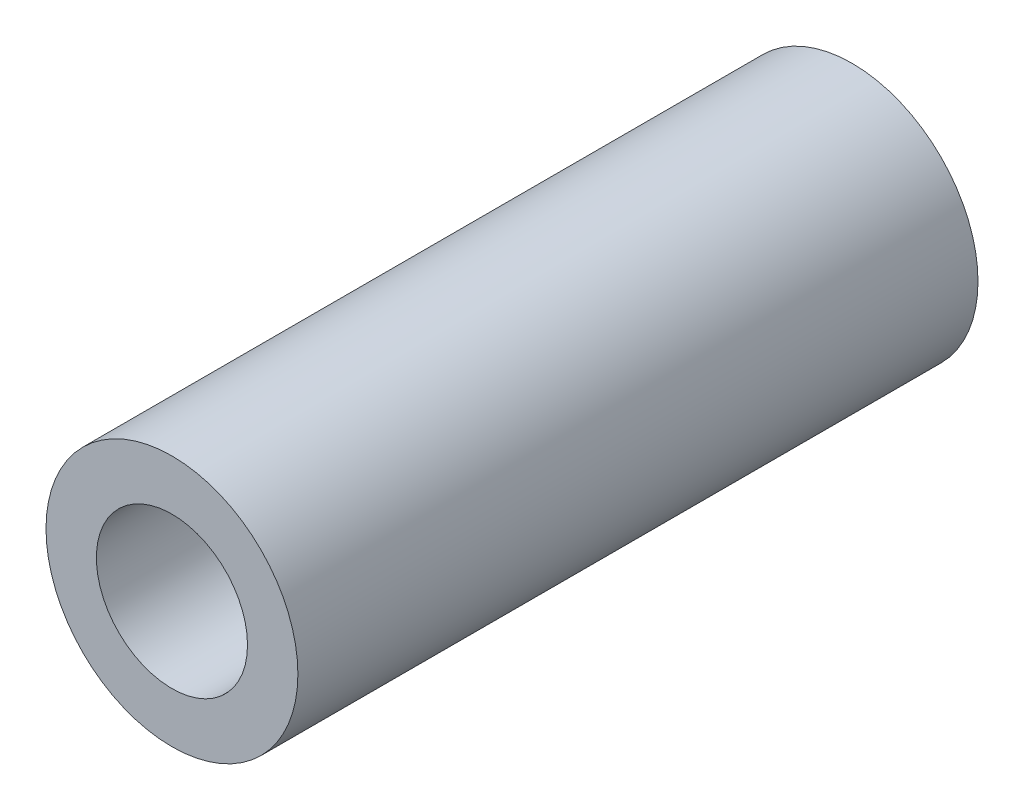
ISO-10303-21;
HEADER;
FILE_DESCRIPTION(('STEP AP214'),'2;1');
FILE_NAME('part.step','',(''),(''),'','','');
FILE_SCHEMA(('AUTOMOTIVE_DESIGN { 1 0 10303 214 1 1 1 1 }'));
ENDSEC;
DATA;
#1=APPLICATION_CONTEXT('core data for automotive mechanical design processes');
#2=APPLICATION_PROTOCOL_DEFINITION('international standard','automotive_design',2000,#1);
#3=PRODUCT_CONTEXT('',#1,'mechanical');
#4=PRODUCT('Part','Part','',(#3));
#5=PRODUCT_RELATED_PRODUCT_CATEGORY('part','',(#4));
#6=PRODUCT_DEFINITION_FORMATION('','',#4);
#7=PRODUCT_DEFINITION_CONTEXT('part definition',#1,'design');
#8=PRODUCT_DEFINITION('design','',#6,#7);
#9=PRODUCT_DEFINITION_SHAPE('','',#8);
#10=(LENGTH_UNIT() NAMED_UNIT(*) SI_UNIT(.MILLI.,.METRE.));
#11=(NAMED_UNIT(*) PLANE_ANGLE_UNIT() SI_UNIT($,.RADIAN.));
#12=(NAMED_UNIT(*) SI_UNIT($,.STERADIAN.) SOLID_ANGLE_UNIT());
#13=UNCERTAINTY_MEASURE_WITH_UNIT(LENGTH_MEASURE(1.E-05),#10,'distance_accuracy_value','');
#14=(GEOMETRIC_REPRESENTATION_CONTEXT(3) GLOBAL_UNCERTAINTY_ASSIGNED_CONTEXT((#13)) GLOBAL_UNIT_ASSIGNED_CONTEXT((#10,
#11,#12)) REPRESENTATION_CONTEXT('',''));
#15=CARTESIAN_POINT('',(0.,0.,0.));
#16=DIRECTION('',(0.,0.,1.));
#17=DIRECTION('',(1.,0.,0.));
#18=AXIS2_PLACEMENT_3D('',#15,#16,#17);
#19=CARTESIAN_POINT('',(0.,0.,27.));
#20=DIRECTION('',(0.,0.,1.));
#21=DIRECTION('',(1.,0.,0.));
#22=AXIS2_PLACEMENT_3D('',#19,#20,#21);
#23=PLANE('',#22);
#24=CARTESIAN_POINT('',(0.,0.,27.));
#25=DIRECTION('',(0.,0.,1.));
#26=DIRECTION('',(1.,0.,0.));
#27=AXIS2_PLACEMENT_3D('',#24,#25,#26);
#28=CIRCLE('',#27,5.);
#29=CARTESIAN_POINT('',(5.,0.,27.));
#30=VERTEX_POINT('',#29);
#31=EDGE_CURVE('E10',#30,#30,#28,.T.);
#32=ORIENTED_EDGE('',*,*,#31,.T.);
#33=EDGE_LOOP('',(#32));
#34=FACE_BOUND('',#33,.T.);
#35=CARTESIAN_POINT('',(0.,0.,27.));
#36=DIRECTION('',(0.,0.,1.));
#37=DIRECTION('',(1.,0.,0.));
#38=AXIS2_PLACEMENT_3D('',#35,#36,#37);
#39=CIRCLE('',#38,3.);
#40=CARTESIAN_POINT('',(3.,0.,27.));
#41=VERTEX_POINT('',#40);
#42=EDGE_CURVE('E42',#41,#41,#39,.T.);
#43=ORIENTED_EDGE('',*,*,#42,.F.);
#44=EDGE_LOOP('',(#43));
#45=FACE_BOUND('',#44,.T.);
#46=ADVANCED_FACE('F31',(#34,#45),#23,.T.);
#47=CARTESIAN_POINT('',(0.,0.,0.));
#48=DIRECTION('',(0.,0.,1.));
#49=DIRECTION('',(1.,0.,0.));
#50=AXIS2_PLACEMENT_3D('',#47,#48,#49);
#51=PLANE('',#50);
#52=CARTESIAN_POINT('',(0.,0.,0.));
#53=DIRECTION('',(0.,0.,1.));
#54=DIRECTION('',(1.,0.,0.));
#55=AXIS2_PLACEMENT_3D('',#52,#53,#54);
#56=CIRCLE('',#55,5.);
#57=CARTESIAN_POINT('',(5.,0.,0.));
#58=VERTEX_POINT('',#57);
#59=EDGE_CURVE('E35',#58,#58,#56,.T.);
#60=ORIENTED_EDGE('',*,*,#59,.F.);
#61=EDGE_LOOP('',(#60));
#62=FACE_BOUND('',#61,.T.);
#63=CARTESIAN_POINT('',(0.,0.,0.));
#64=DIRECTION('',(0.,0.,1.));
#65=DIRECTION('',(1.,0.,0.));
#66=AXIS2_PLACEMENT_3D('',#63,#64,#65);
#67=CIRCLE('',#66,3.);
#68=CARTESIAN_POINT('',(3.,0.,0.));
#69=VERTEX_POINT('',#68);
#70=EDGE_CURVE('E44',#69,#69,#67,.T.);
#71=ORIENTED_EDGE('',*,*,#70,.T.);
#72=EDGE_LOOP('',(#71));
#73=FACE_BOUND('',#72,.T.);
#74=ADVANCED_FACE('F54',(#62,#73),#51,.F.);
#75=CARTESIAN_POINT('',(0.,0.,27.));
#76=DIRECTION('',(0.,0.,-1.));
#77=DIRECTION('',(-1.,0.,0.));
#78=AXIS2_PLACEMENT_3D('',#75,#76,#77);
#79=CYLINDRICAL_SURFACE('',#78,5.);
#80=ORIENTED_EDGE('',*,*,#31,.F.);
#81=EDGE_LOOP('',(#80));
#82=FACE_BOUND('',#81,.T.);
#83=ORIENTED_EDGE('',*,*,#59,.T.);
#84=EDGE_LOOP('',(#83));
#85=FACE_BOUND('',#84,.T.);
#86=ADVANCED_FACE('F33',(#82,#85),#79,.T.);
#87=CARTESIAN_POINT('',(0.,0.,27.));
#88=DIRECTION('',(0.,0.,-1.));
#89=DIRECTION('',(-1.,0.,0.));
#90=AXIS2_PLACEMENT_3D('',#87,#88,#89);
#91=CYLINDRICAL_SURFACE('',#90,3.);
#92=ORIENTED_EDGE('',*,*,#42,.T.);
#93=EDGE_LOOP('',(#92));
#94=FACE_BOUND('',#93,.T.);
#95=ORIENTED_EDGE('',*,*,#70,.F.);
#96=EDGE_LOOP('',(#95));
#97=FACE_BOUND('',#96,.T.);
#98=ADVANCED_FACE('F50',(#94,#97),#91,.F.);
#99=CLOSED_SHELL('',(#46,#74,#86,#98));
#100=MANIFOLD_SOLID_BREP('B2',#99);
#101=ADVANCED_BREP_SHAPE_REPRESENTATION('',(#18,#100),#14);
#102=SHAPE_DEFINITION_REPRESENTATION(#9,#101);
ENDSEC;
END-ISO-10303-21;
